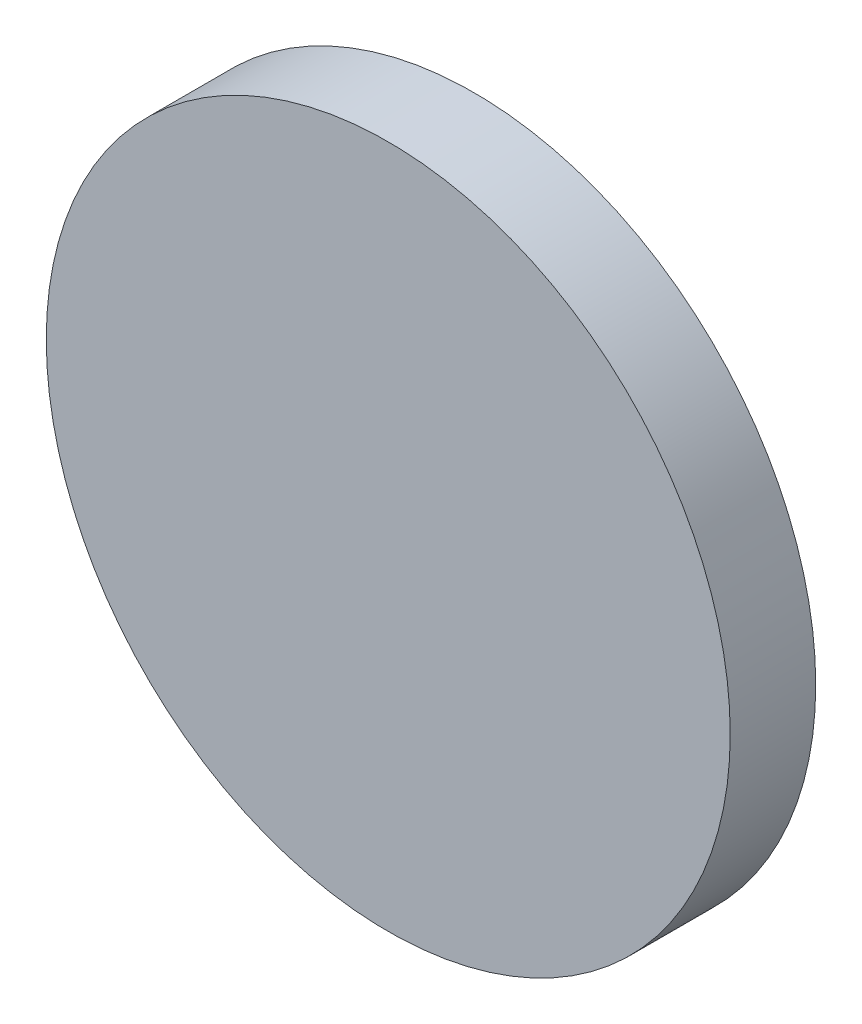
ISO-10303-21;
HEADER;
FILE_DESCRIPTION(('STEP AP214'),'2;1');
FILE_NAME('part.step','',(''),(''),'','','');
FILE_SCHEMA(('AUTOMOTIVE_DESIGN { 1 0 10303 214 1 1 1 1 }'));
ENDSEC;
DATA;
#1=APPLICATION_CONTEXT('core data for automotive mechanical design processes');
#2=APPLICATION_PROTOCOL_DEFINITION('international standard','automotive_design',2000,#1);
#3=PRODUCT_CONTEXT('',#1,'mechanical');
#4=PRODUCT('Part','Part','',(#3));
#5=PRODUCT_RELATED_PRODUCT_CATEGORY('part','',(#4));
#6=PRODUCT_DEFINITION_FORMATION('','',#4);
#7=PRODUCT_DEFINITION_CONTEXT('part definition',#1,'design');
#8=PRODUCT_DEFINITION('design','',#6,#7);
#9=PRODUCT_DEFINITION_SHAPE('','',#8);
#10=(LENGTH_UNIT() NAMED_UNIT(*) SI_UNIT(.MILLI.,.METRE.));
#11=(NAMED_UNIT(*) PLANE_ANGLE_UNIT() SI_UNIT($,.RADIAN.));
#12=(NAMED_UNIT(*) SI_UNIT($,.STERADIAN.) SOLID_ANGLE_UNIT());
#13=UNCERTAINTY_MEASURE_WITH_UNIT(LENGTH_MEASURE(1.E-05),#10,'distance_accuracy_value','');
#14=(GEOMETRIC_REPRESENTATION_CONTEXT(3) GLOBAL_UNCERTAINTY_ASSIGNED_CONTEXT((#13)) GLOBAL_UNIT_ASSIGNED_CONTEXT((#10,
#11,#12)) REPRESENTATION_CONTEXT('',''));
#15=CARTESIAN_POINT('',(0.,0.,0.));
#16=DIRECTION('',(0.,0.,1.));
#17=DIRECTION('',(1.,0.,0.));
#18=AXIS2_PLACEMENT_3D('',#15,#16,#17);
#19=CARTESIAN_POINT('',(0.,0.,1.));
#20=DIRECTION('',(0.,0.,-1.));
#21=DIRECTION('',(-1.,0.,0.));
#22=AXIS2_PLACEMENT_3D('',#19,#20,#21);
#23=CYLINDRICAL_SURFACE('',#22,4.);
#24=CARTESIAN_POINT('',(0.,0.,1.));
#25=DIRECTION('',(0.,0.,1.));
#26=DIRECTION('',(1.,0.,0.));
#27=AXIS2_PLACEMENT_3D('',#24,#25,#26);
#28=CIRCLE('',#27,4.);
#29=CARTESIAN_POINT('',(4.,0.,1.));
#30=VERTEX_POINT('',#29);
#31=EDGE_CURVE('E10',#30,#30,#28,.T.);
#32=ORIENTED_EDGE('',*,*,#31,.F.);
#33=EDGE_LOOP('',(#32));
#34=FACE_BOUND('',#33,.T.);
#35=CARTESIAN_POINT('',(0.,0.,0.));
#36=DIRECTION('',(0.,0.,1.));
#37=DIRECTION('',(1.,0.,0.));
#38=AXIS2_PLACEMENT_3D('',#35,#36,#37);
#39=CIRCLE('',#38,4.);
#40=CARTESIAN_POINT('',(4.,0.,0.));
#41=VERTEX_POINT('',#40);
#42=EDGE_CURVE('E38',#41,#41,#39,.T.);
#43=ORIENTED_EDGE('',*,*,#42,.T.);
#44=EDGE_LOOP('',(#43));
#45=FACE_BOUND('',#44,.T.);
#46=ADVANCED_FACE('F35',(#34,#45),#23,.T.);
#47=CARTESIAN_POINT('',(0.,0.,1.));
#48=DIRECTION('',(0.,0.,1.));
#49=DIRECTION('',(1.,0.,0.));
#50=AXIS2_PLACEMENT_3D('',#47,#48,#49);
#51=PLANE('',#50);
#52=ORIENTED_EDGE('',*,*,#31,.T.);
#53=EDGE_LOOP('',(#52));
#54=FACE_BOUND('',#53,.T.);
#55=ADVANCED_FACE('F50',(#54),#51,.T.);
#56=CARTESIAN_POINT('',(0.,0.,0.));
#57=DIRECTION('',(0.,0.,1.));
#58=DIRECTION('',(1.,0.,0.));
#59=AXIS2_PLACEMENT_3D('',#56,#57,#58);
#60=PLANE('',#59);
#61=ORIENTED_EDGE('',*,*,#42,.F.);
#62=EDGE_LOOP('',(#61));
#63=FACE_BOUND('',#62,.T.);
#64=ADVANCED_FACE('F48',(#63),#60,.F.);
#65=CLOSED_SHELL('',(#46,#55,#64));
#66=MANIFOLD_SOLID_BREP('B2',#65);
#67=ADVANCED_BREP_SHAPE_REPRESENTATION('',(#18,#66),#14);
#68=SHAPE_DEFINITION_REPRESENTATION(#9,#67);
ENDSEC;
END-ISO-10303-21;
